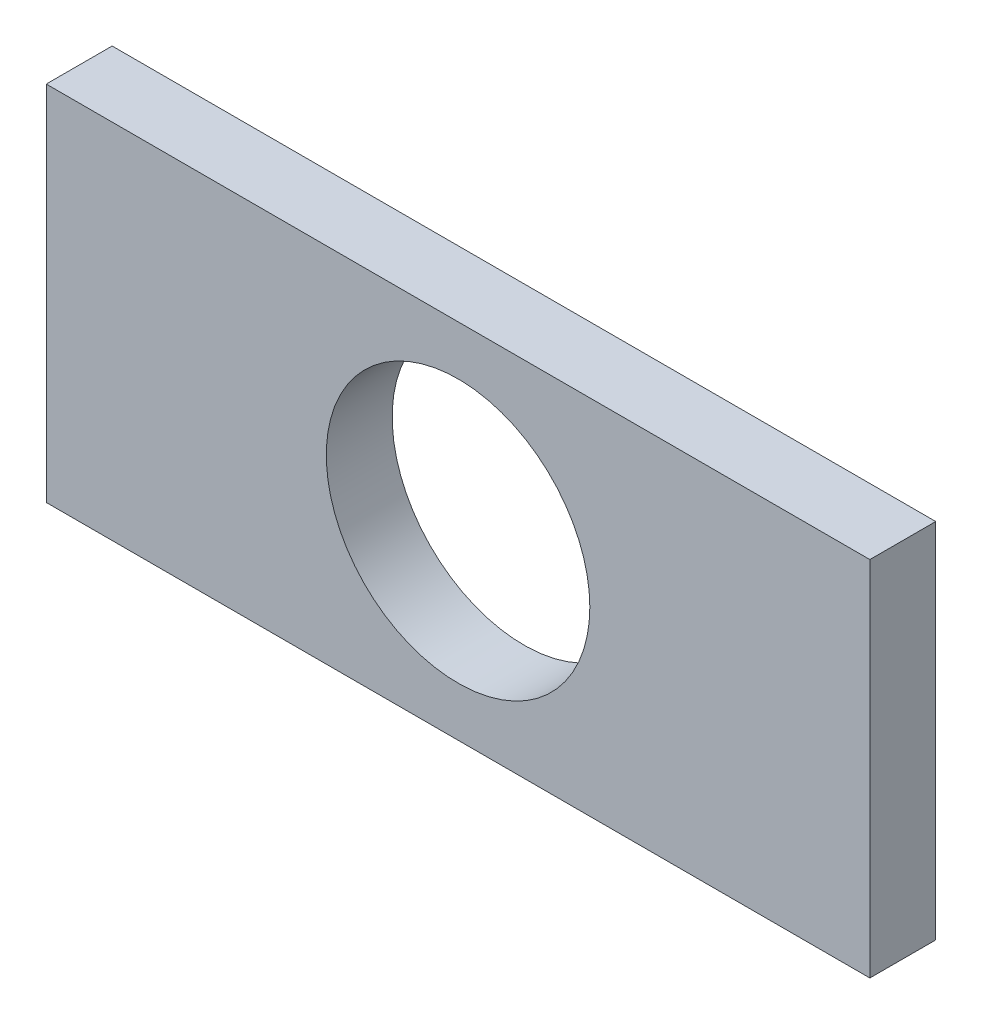
ISO-10303-21;
HEADER;
FILE_DESCRIPTION(('STEP AP214'),'2;1');
FILE_NAME('part.step','',(''),(''),'','','');
FILE_SCHEMA(('AUTOMOTIVE_DESIGN { 1 0 10303 214 1 1 1 1 }'));
ENDSEC;
DATA;
#1=APPLICATION_CONTEXT('core data for automotive mechanical design processes');
#2=APPLICATION_PROTOCOL_DEFINITION('international standard','automotive_design',2000,#1);
#3=PRODUCT_CONTEXT('',#1,'mechanical');
#4=PRODUCT('Part','Part','',(#3));
#5=PRODUCT_RELATED_PRODUCT_CATEGORY('part','',(#4));
#6=PRODUCT_DEFINITION_FORMATION('','',#4);
#7=PRODUCT_DEFINITION_CONTEXT('part definition',#1,'design');
#8=PRODUCT_DEFINITION('design','',#6,#7);
#9=PRODUCT_DEFINITION_SHAPE('','',#8);
#10=(LENGTH_UNIT() NAMED_UNIT(*) SI_UNIT(.MILLI.,.METRE.));
#11=(NAMED_UNIT(*) PLANE_ANGLE_UNIT() SI_UNIT($,.RADIAN.));
#12=(NAMED_UNIT(*) SI_UNIT($,.STERADIAN.) SOLID_ANGLE_UNIT());
#13=UNCERTAINTY_MEASURE_WITH_UNIT(LENGTH_MEASURE(1.E-05),#10,'distance_accuracy_value','');
#14=(GEOMETRIC_REPRESENTATION_CONTEXT(3) GLOBAL_UNCERTAINTY_ASSIGNED_CONTEXT((#13)) GLOBAL_UNIT_ASSIGNED_CONTEXT((#10,
#11,#12)) REPRESENTATION_CONTEXT('',''));
#15=CARTESIAN_POINT('',(0.,0.,0.));
#16=DIRECTION('',(0.,0.,1.));
#17=DIRECTION('',(1.,0.,0.));
#18=AXIS2_PLACEMENT_3D('',#15,#16,#17);
#19=CARTESIAN_POINT('',(0.,0.,3.));
#20=DIRECTION('',(0.,0.,1.));
#21=DIRECTION('',(1.,0.,0.));
#22=AXIS2_PLACEMENT_3D('',#19,#20,#21);
#23=PLANE('',#22);
#24=DIRECTION('',(0.,-1.,0.));
#25=VECTOR('',#24,1.);
#26=CARTESIAN_POINT('',(-18.75,-8.25,3.));
#27=LINE('',#26,#25);
#28=CARTESIAN_POINT('',(-18.75,8.25,3.));
#29=VERTEX_POINT('',#28);
#30=CARTESIAN_POINT('',(-18.75,-8.25,3.));
#31=VERTEX_POINT('',#30);
#32=EDGE_CURVE('E87',#29,#31,#27,.T.);
#33=ORIENTED_EDGE('',*,*,#32,.T.);
#34=DIRECTION('',(1.,0.,0.));
#35=VECTOR('',#34,1.);
#36=CARTESIAN_POINT('',(18.75,-8.24999999999999,3.));
#37=LINE('',#36,#35);
#38=CARTESIAN_POINT('',(18.75,-8.24999999999999,3.));
#39=VERTEX_POINT('',#38);
#40=EDGE_CURVE('E82',#31,#39,#37,.T.);
#41=ORIENTED_EDGE('',*,*,#40,.T.);
#42=DIRECTION('',(0.,1.,0.));
#43=VECTOR('',#42,1.);
#44=CARTESIAN_POINT('',(18.75,-8.24999999999999,3.));
#45=LINE('',#44,#43);
#46=CARTESIAN_POINT('',(18.75,8.25,3.));
#47=VERTEX_POINT('',#46);
#48=EDGE_CURVE('E85',#39,#47,#45,.T.);
#49=ORIENTED_EDGE('',*,*,#48,.T.);
#50=DIRECTION('',(-1.,0.,0.));
#51=VECTOR('',#50,1.);
#52=CARTESIAN_POINT('',(18.75,8.25,3.));
#53=LINE('',#52,#51);
#54=EDGE_CURVE('E52',#47,#29,#53,.T.);
#55=ORIENTED_EDGE('',*,*,#54,.T.);
#56=EDGE_LOOP('',(#33,#41,#49,#55));
#57=FACE_BOUND('',#56,.T.);
#58=CARTESIAN_POINT('',(0.,0.,3.));
#59=DIRECTION('',(0.,0.,1.));
#60=DIRECTION('',(1.,0.,0.));
#61=AXIS2_PLACEMENT_3D('',#58,#59,#60);
#62=CIRCLE('',#61,6.);
#63=CARTESIAN_POINT('',(6.,0.,3.));
#64=VERTEX_POINT('',#63);
#65=EDGE_CURVE('E102',#64,#64,#62,.T.);
#66=ORIENTED_EDGE('',*,*,#65,.F.);
#67=EDGE_LOOP('',(#66));
#68=FACE_BOUND('',#67,.T.);
#69=ADVANCED_FACE('F35',(#57,#68),#23,.T.);
#70=CARTESIAN_POINT('',(0.,0.,0.));
#71=DIRECTION('',(0.,0.,1.));
#72=DIRECTION('',(1.,0.,0.));
#73=AXIS2_PLACEMENT_3D('',#70,#71,#72);
#74=PLANE('',#73);
#75=DIRECTION('',(0.,-1.,0.));
#76=VECTOR('',#75,1.);
#77=CARTESIAN_POINT('',(-18.75,-8.25,0.));
#78=LINE('',#77,#76);
#79=CARTESIAN_POINT('',(-18.75,8.25,0.));
#80=VERTEX_POINT('',#79);
#81=CARTESIAN_POINT('',(-18.75,-8.25,0.));
#82=VERTEX_POINT('',#81);
#83=EDGE_CURVE('E99',#80,#82,#78,.T.);
#84=ORIENTED_EDGE('',*,*,#83,.F.);
#85=DIRECTION('',(-1.,0.,0.));
#86=VECTOR('',#85,1.);
#87=CARTESIAN_POINT('',(18.75,8.25,0.));
#88=LINE('',#87,#86);
#89=CARTESIAN_POINT('',(18.75,8.25,0.));
#90=VERTEX_POINT('',#89);
#91=EDGE_CURVE('E75',#90,#80,#88,.T.);
#92=ORIENTED_EDGE('',*,*,#91,.F.);
#93=DIRECTION('',(0.,1.,0.));
#94=VECTOR('',#93,1.);
#95=CARTESIAN_POINT('',(18.75,-8.24999999999999,0.));
#96=LINE('',#95,#94);
#97=CARTESIAN_POINT('',(18.75,-8.24999999999999,0.));
#98=VERTEX_POINT('',#97);
#99=EDGE_CURVE('E69',#98,#90,#96,.T.);
#100=ORIENTED_EDGE('',*,*,#99,.F.);
#101=DIRECTION('',(1.,0.,0.));
#102=VECTOR('',#101,1.);
#103=CARTESIAN_POINT('',(18.75,-8.24999999999999,0.));
#104=LINE('',#103,#102);
#105=EDGE_CURVE('E91',#82,#98,#104,.T.);
#106=ORIENTED_EDGE('',*,*,#105,.F.);
#107=EDGE_LOOP('',(#84,#92,#100,#106));
#108=FACE_BOUND('',#107,.T.);
#109=CARTESIAN_POINT('',(0.,0.,0.));
#110=DIRECTION('',(0.,0.,1.));
#111=DIRECTION('',(1.,0.,0.));
#112=AXIS2_PLACEMENT_3D('',#109,#110,#111);
#113=CIRCLE('',#112,6.);
#114=CARTESIAN_POINT('',(6.,0.,0.));
#115=VERTEX_POINT('',#114);
#116=EDGE_CURVE('E114',#115,#115,#113,.T.);
#117=ORIENTED_EDGE('',*,*,#116,.T.);
#118=EDGE_LOOP('',(#117));
#119=FACE_BOUND('',#118,.T.);
#120=ADVANCED_FACE('F110',(#108,#119),#74,.F.);
#121=CARTESIAN_POINT('',(-18.75,-8.25,3.));
#122=DIRECTION('',(1.,0.,0.));
#123=DIRECTION('',(0.,0.,-1.));
#124=AXIS2_PLACEMENT_3D('',#121,#122,#123);
#125=PLANE('',#124);
#126=ORIENTED_EDGE('',*,*,#83,.T.);
#127=DIRECTION('',(0.,0.,-1.));
#128=VECTOR('',#127,1.);
#129=CARTESIAN_POINT('',(-18.75,-8.25,3.));
#130=LINE('',#129,#128);
#131=EDGE_CURVE('E11',#31,#82,#130,.T.);
#132=ORIENTED_EDGE('',*,*,#131,.F.);
#133=ORIENTED_EDGE('',*,*,#32,.F.);
#134=DIRECTION('',(0.,0.,-1.));
#135=VECTOR('',#134,1.);
#136=CARTESIAN_POINT('',(-18.75,8.25,3.));
#137=LINE('',#136,#135);
#138=EDGE_CURVE('E95',#29,#80,#137,.T.);
#139=ORIENTED_EDGE('',*,*,#138,.T.);
#140=EDGE_LOOP('',(#126,#132,#133,#139));
#141=FACE_BOUND('',#140,.T.);
#142=ADVANCED_FACE('F37',(#141),#125,.F.);
#143=CARTESIAN_POINT('',(18.75,-8.24999999999999,3.));
#144=DIRECTION('',(0.,1.,0.));
#145=DIRECTION('',(-1.,0.,0.));
#146=AXIS2_PLACEMENT_3D('',#143,#144,#145);
#147=PLANE('',#146);
#148=ORIENTED_EDGE('',*,*,#105,.T.);
#149=DIRECTION('',(0.,0.,-1.));
#150=VECTOR('',#149,1.);
#151=CARTESIAN_POINT('',(18.75,-8.24999999999999,3.));
#152=LINE('',#151,#150);
#153=EDGE_CURVE('E44',#39,#98,#152,.T.);
#154=ORIENTED_EDGE('',*,*,#153,.F.);
#155=ORIENTED_EDGE('',*,*,#40,.F.);
#156=ORIENTED_EDGE('',*,*,#131,.T.);
#157=EDGE_LOOP('',(#148,#154,#155,#156));
#158=FACE_BOUND('',#157,.T.);
#159=ADVANCED_FACE('F90',(#158),#147,.F.);
#160=CARTESIAN_POINT('',(18.75,-8.24999999999999,3.));
#161=DIRECTION('',(-1.,0.,0.));
#162=DIRECTION('',(0.,0.,1.));
#163=AXIS2_PLACEMENT_3D('',#160,#161,#162);
#164=PLANE('',#163);
#165=ORIENTED_EDGE('',*,*,#99,.T.);
#166=DIRECTION('',(0.,0.,-1.));
#167=VECTOR('',#166,1.);
#168=CARTESIAN_POINT('',(18.75,8.25,3.));
#169=LINE('',#168,#167);
#170=EDGE_CURVE('E92',#47,#90,#169,.T.);
#171=ORIENTED_EDGE('',*,*,#170,.F.);
#172=ORIENTED_EDGE('',*,*,#48,.F.);
#173=ORIENTED_EDGE('',*,*,#153,.T.);
#174=EDGE_LOOP('',(#165,#171,#172,#173));
#175=FACE_BOUND('',#174,.T.);
#176=ADVANCED_FACE('F93',(#175),#164,.F.);
#177=CARTESIAN_POINT('',(18.75,8.25,3.));
#178=DIRECTION('',(0.,-1.,0.));
#179=DIRECTION('',(1.,0.,0.));
#180=AXIS2_PLACEMENT_3D('',#177,#178,#179);
#181=PLANE('',#180);
#182=ORIENTED_EDGE('',*,*,#91,.T.);
#183=ORIENTED_EDGE('',*,*,#138,.F.);
#184=ORIENTED_EDGE('',*,*,#54,.F.);
#185=ORIENTED_EDGE('',*,*,#170,.T.);
#186=EDGE_LOOP('',(#182,#183,#184,#185));
#187=FACE_BOUND('',#186,.T.);
#188=ADVANCED_FACE('F107',(#187),#181,.F.);
#189=CARTESIAN_POINT('',(0.,0.,3.));
#190=DIRECTION('',(0.,0.,-1.));
#191=DIRECTION('',(-1.,0.,0.));
#192=AXIS2_PLACEMENT_3D('',#189,#190,#191);
#193=CYLINDRICAL_SURFACE('',#192,6.);
#194=ORIENTED_EDGE('',*,*,#65,.T.);
#195=EDGE_LOOP('',(#194));
#196=FACE_BOUND('',#195,.T.);
#197=ORIENTED_EDGE('',*,*,#116,.F.);
#198=EDGE_LOOP('',(#197));
#199=FACE_BOUND('',#198,.T.);
#200=ADVANCED_FACE('F120',(#196,#199),#193,.F.);
#201=CLOSED_SHELL('',(#69,#120,#142,#159,#176,#188,#200));
#202=MANIFOLD_SOLID_BREP('B2',#201);
#203=ADVANCED_BREP_SHAPE_REPRESENTATION('',(#18,#202),#14);
#204=SHAPE_DEFINITION_REPRESENTATION(#9,#203);
ENDSEC;
END-ISO-10303-21;
